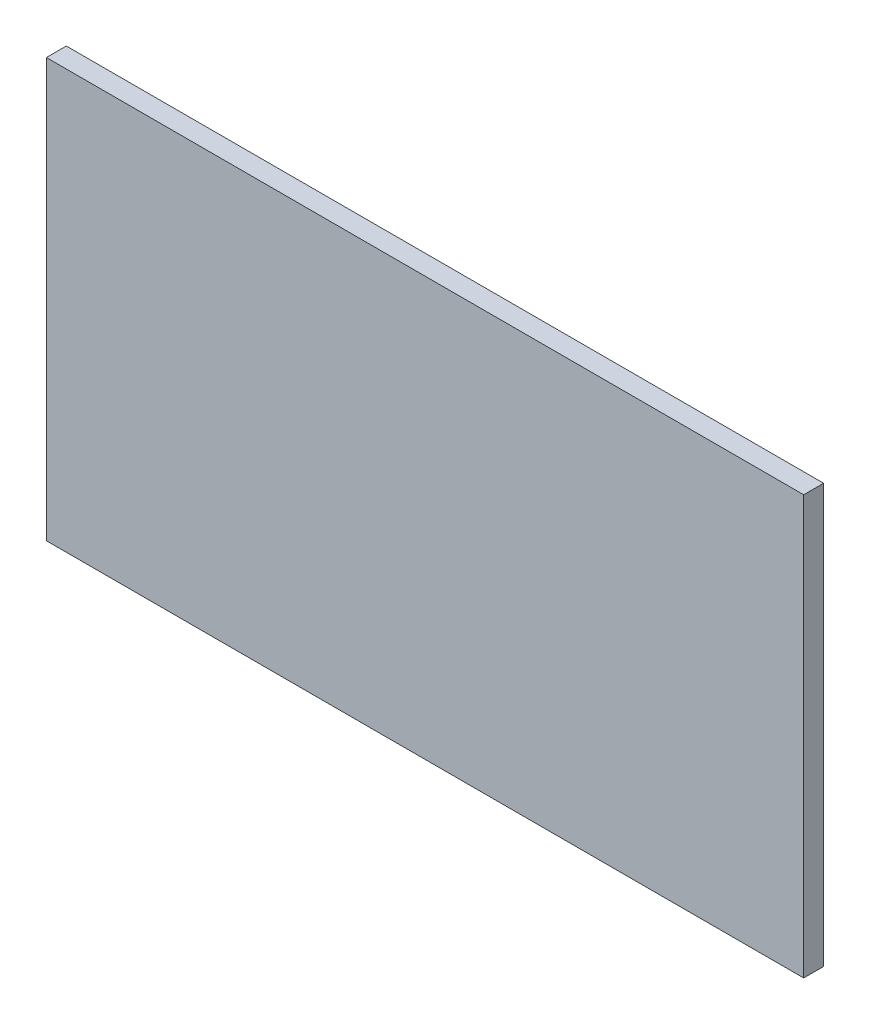
ISO-10303-21;
HEADER;
FILE_DESCRIPTION(('STEP AP214'),'2;1');
FILE_NAME('part.step','',(''),(''),'','','');
FILE_SCHEMA(('AUTOMOTIVE_DESIGN { 1 0 10303 214 1 1 1 1 }'));
ENDSEC;
DATA;
#1=APPLICATION_CONTEXT('core data for automotive mechanical design processes');
#2=APPLICATION_PROTOCOL_DEFINITION('international standard','automotive_design',2000,#1);
#3=PRODUCT_CONTEXT('',#1,'mechanical');
#4=PRODUCT('Part','Part','',(#3));
#5=PRODUCT_RELATED_PRODUCT_CATEGORY('part','',(#4));
#6=PRODUCT_DEFINITION_FORMATION('','',#4);
#7=PRODUCT_DEFINITION_CONTEXT('part definition',#1,'design');
#8=PRODUCT_DEFINITION('design','',#6,#7);
#9=PRODUCT_DEFINITION_SHAPE('','',#8);
#10=(LENGTH_UNIT() NAMED_UNIT(*) SI_UNIT(.MILLI.,.METRE.));
#11=(NAMED_UNIT(*) PLANE_ANGLE_UNIT() SI_UNIT($,.RADIAN.));
#12=(NAMED_UNIT(*) SI_UNIT($,.STERADIAN.) SOLID_ANGLE_UNIT());
#13=UNCERTAINTY_MEASURE_WITH_UNIT(LENGTH_MEASURE(1.E-05),#10,'distance_accuracy_value','');
#14=(GEOMETRIC_REPRESENTATION_CONTEXT(3) GLOBAL_UNCERTAINTY_ASSIGNED_CONTEXT((#13)) GLOBAL_UNIT_ASSIGNED_CONTEXT((#10,
#11,#12)) REPRESENTATION_CONTEXT('',''));
#15=CARTESIAN_POINT('',(0.,0.,0.));
#16=DIRECTION('',(0.,0.,1.));
#17=DIRECTION('',(1.,0.,0.));
#18=AXIS2_PLACEMENT_3D('',#15,#16,#17);
#19=CARTESIAN_POINT('',(-190.,105.,10.));
#20=DIRECTION('',(1.,0.,0.));
#21=DIRECTION('',(0.,0.,-1.));
#22=AXIS2_PLACEMENT_3D('',#19,#20,#21);
#23=PLANE('',#22);
#24=DIRECTION('',(0.,-1.,0.));
#25=VECTOR('',#24,1.);
#26=CARTESIAN_POINT('',(-190.,105.,0.));
#27=LINE('',#26,#25);
#28=CARTESIAN_POINT('',(-190.,105.,0.));
#29=VERTEX_POINT('',#28);
#30=CARTESIAN_POINT('',(-190.,-105.,0.));
#31=VERTEX_POINT('',#30);
#32=EDGE_CURVE('E96',#29,#31,#27,.T.);
#33=ORIENTED_EDGE('',*,*,#32,.T.);
#34=DIRECTION('',(0.,0.,-1.));
#35=VECTOR('',#34,1.);
#36=CARTESIAN_POINT('',(-190.,-105.,10.));
#37=LINE('',#36,#35);
#38=CARTESIAN_POINT('',(-190.,-105.,10.));
#39=VERTEX_POINT('',#38);
#40=EDGE_CURVE('E11',#39,#31,#37,.T.);
#41=ORIENTED_EDGE('',*,*,#40,.F.);
#42=DIRECTION('',(0.,-1.,0.));
#43=VECTOR('',#42,1.);
#44=CARTESIAN_POINT('',(-190.,105.,10.));
#45=LINE('',#44,#43);
#46=CARTESIAN_POINT('',(-190.,105.,10.));
#47=VERTEX_POINT('',#46);
#48=EDGE_CURVE('E84',#47,#39,#45,.T.);
#49=ORIENTED_EDGE('',*,*,#48,.F.);
#50=DIRECTION('',(0.,0.,-1.));
#51=VECTOR('',#50,1.);
#52=CARTESIAN_POINT('',(-190.,105.,10.));
#53=LINE('',#52,#51);
#54=EDGE_CURVE('E92',#47,#29,#53,.T.);
#55=ORIENTED_EDGE('',*,*,#54,.T.);
#56=EDGE_LOOP('',(#33,#41,#49,#55));
#57=FACE_BOUND('',#56,.T.);
#58=ADVANCED_FACE('F33',(#57),#23,.F.);
#59=CARTESIAN_POINT('',(-190.,-105.,10.));
#60=DIRECTION('',(0.,1.,0.));
#61=DIRECTION('',(0.,0.,1.));
#62=AXIS2_PLACEMENT_3D('',#59,#60,#61);
#63=PLANE('',#62);
#64=DIRECTION('',(1.,0.,0.));
#65=VECTOR('',#64,1.);
#66=CARTESIAN_POINT('',(-190.,-105.,0.));
#67=LINE('',#66,#65);
#68=CARTESIAN_POINT('',(190.,-105.,0.));
#69=VERTEX_POINT('',#68);
#70=EDGE_CURVE('E88',#31,#69,#67,.T.);
#71=ORIENTED_EDGE('',*,*,#70,.T.);
#72=DIRECTION('',(0.,0.,-1.));
#73=VECTOR('',#72,1.);
#74=CARTESIAN_POINT('',(190.,-105.,10.));
#75=LINE('',#74,#73);
#76=CARTESIAN_POINT('',(190.,-105.,10.));
#77=VERTEX_POINT('',#76);
#78=EDGE_CURVE('E41',#77,#69,#75,.T.);
#79=ORIENTED_EDGE('',*,*,#78,.F.);
#80=DIRECTION('',(1.,0.,0.));
#81=VECTOR('',#80,1.);
#82=CARTESIAN_POINT('',(-190.,-105.,10.));
#83=LINE('',#82,#81);
#84=EDGE_CURVE('E79',#39,#77,#83,.T.);
#85=ORIENTED_EDGE('',*,*,#84,.F.);
#86=ORIENTED_EDGE('',*,*,#40,.T.);
#87=EDGE_LOOP('',(#71,#79,#85,#86));
#88=FACE_BOUND('',#87,.T.);
#89=ADVANCED_FACE('F87',(#88),#63,.F.);
#90=CARTESIAN_POINT('',(190.,105.,10.));
#91=DIRECTION('',(-1.,0.,0.));
#92=DIRECTION('',(0.,-1.,0.));
#93=AXIS2_PLACEMENT_3D('',#90,#91,#92);
#94=PLANE('',#93);
#95=DIRECTION('',(0.,1.,0.));
#96=VECTOR('',#95,1.);
#97=CARTESIAN_POINT('',(190.,105.,0.));
#98=LINE('',#97,#96);
#99=CARTESIAN_POINT('',(190.,105.,0.));
#100=VERTEX_POINT('',#99);
#101=EDGE_CURVE('E66',#69,#100,#98,.T.);
#102=ORIENTED_EDGE('',*,*,#101,.T.);
#103=DIRECTION('',(0.,0.,-1.));
#104=VECTOR('',#103,1.);
#105=CARTESIAN_POINT('',(190.,105.,10.));
#106=LINE('',#105,#104);
#107=CARTESIAN_POINT('',(190.,105.,10.));
#108=VERTEX_POINT('',#107);
#109=EDGE_CURVE('E89',#108,#100,#106,.T.);
#110=ORIENTED_EDGE('',*,*,#109,.F.);
#111=DIRECTION('',(0.,1.,0.));
#112=VECTOR('',#111,1.);
#113=CARTESIAN_POINT('',(190.,105.,10.));
#114=LINE('',#113,#112);
#115=EDGE_CURVE('E82',#77,#108,#114,.T.);
#116=ORIENTED_EDGE('',*,*,#115,.F.);
#117=ORIENTED_EDGE('',*,*,#78,.T.);
#118=EDGE_LOOP('',(#102,#110,#116,#117));
#119=FACE_BOUND('',#118,.T.);
#120=ADVANCED_FACE('F90',(#119),#94,.F.);
#121=CARTESIAN_POINT('',(-190.,105.,10.));
#122=DIRECTION('',(0.,-1.,0.));
#123=DIRECTION('',(1.,0.,0.));
#124=AXIS2_PLACEMENT_3D('',#121,#122,#123);
#125=PLANE('',#124);
#126=DIRECTION('',(-1.,0.,0.));
#127=VECTOR('',#126,1.);
#128=CARTESIAN_POINT('',(-190.,105.,0.));
#129=LINE('',#128,#127);
#130=EDGE_CURVE('E72',#100,#29,#129,.T.);
#131=ORIENTED_EDGE('',*,*,#130,.T.);
#132=ORIENTED_EDGE('',*,*,#54,.F.);
#133=DIRECTION('',(-1.,0.,0.));
#134=VECTOR('',#133,1.);
#135=CARTESIAN_POINT('',(-190.,105.,10.));
#136=LINE('',#135,#134);
#137=EDGE_CURVE('E49',#108,#47,#136,.T.);
#138=ORIENTED_EDGE('',*,*,#137,.F.);
#139=ORIENTED_EDGE('',*,*,#109,.T.);
#140=EDGE_LOOP('',(#131,#132,#138,#139));
#141=FACE_BOUND('',#140,.T.);
#142=ADVANCED_FACE('F103',(#141),#125,.F.);
#143=CARTESIAN_POINT('',(0.,0.,10.));
#144=DIRECTION('',(0.,0.,1.));
#145=DIRECTION('',(1.,0.,0.));
#146=AXIS2_PLACEMENT_3D('',#143,#144,#145);
#147=PLANE('',#146);
#148=ORIENTED_EDGE('',*,*,#48,.T.);
#149=ORIENTED_EDGE('',*,*,#84,.T.);
#150=ORIENTED_EDGE('',*,*,#115,.T.);
#151=ORIENTED_EDGE('',*,*,#137,.T.);
#152=EDGE_LOOP('',(#148,#149,#150,#151));
#153=FACE_BOUND('',#152,.T.);
#154=ADVANCED_FACE('F80',(#153),#147,.T.);
#155=CARTESIAN_POINT('',(0.,0.,0.));
#156=DIRECTION('',(0.,0.,1.));
#157=DIRECTION('',(1.,0.,0.));
#158=AXIS2_PLACEMENT_3D('',#155,#156,#157);
#159=PLANE('',#158);
#160=ORIENTED_EDGE('',*,*,#32,.F.);
#161=ORIENTED_EDGE('',*,*,#130,.F.);
#162=ORIENTED_EDGE('',*,*,#101,.F.);
#163=ORIENTED_EDGE('',*,*,#70,.F.);
#164=EDGE_LOOP('',(#160,#161,#162,#163));
#165=FACE_BOUND('',#164,.T.);
#166=ADVANCED_FACE('F106',(#165),#159,.F.);
#167=CLOSED_SHELL('',(#58,#89,#120,#142,#154,#166));
#168=MANIFOLD_SOLID_BREP('B2',#167);
#169=ADVANCED_BREP_SHAPE_REPRESENTATION('',(#18,#168),#14);
#170=SHAPE_DEFINITION_REPRESENTATION(#9,#169);
ENDSEC;
END-ISO-10303-21;
